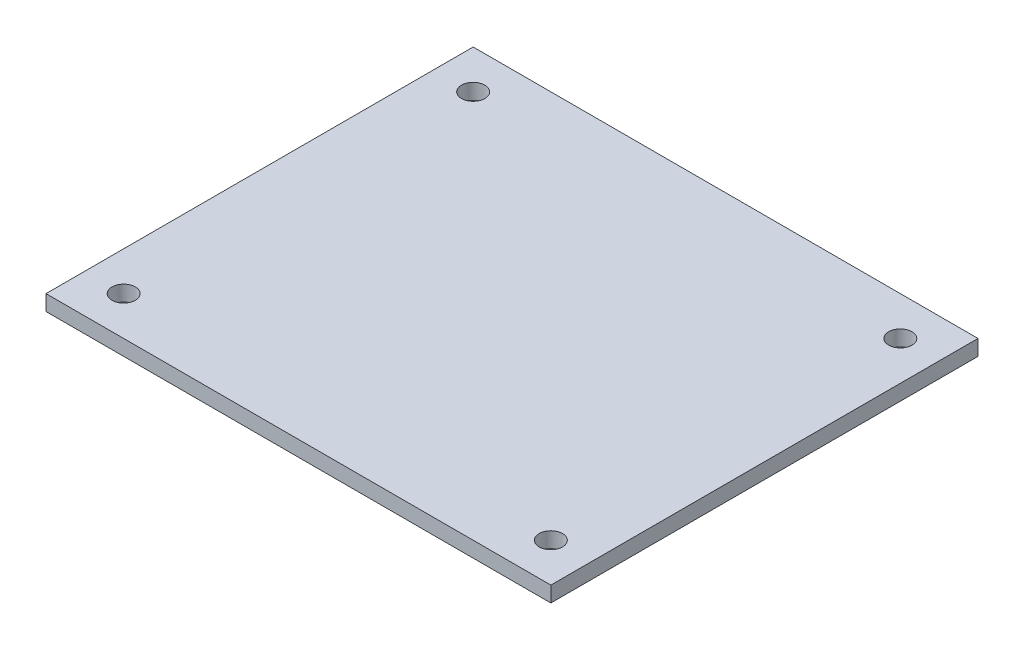
ISO-10303-21;
HEADER;
FILE_DESCRIPTION(('STEP AP214'),'2;1');
FILE_NAME('part.step','',(''),(''),'','','');
FILE_SCHEMA(('AUTOMOTIVE_DESIGN { 1 0 10303 214 1 1 1 1 }'));
ENDSEC;
DATA;
#1=APPLICATION_CONTEXT('core data for automotive mechanical design processes');
#2=APPLICATION_PROTOCOL_DEFINITION('international standard','automotive_design',2000,#1);
#3=PRODUCT_CONTEXT('',#1,'mechanical');
#4=PRODUCT('Part','Part','',(#3));
#5=PRODUCT_RELATED_PRODUCT_CATEGORY('part','',(#4));
#6=PRODUCT_DEFINITION_FORMATION('','',#4);
#7=PRODUCT_DEFINITION_CONTEXT('part definition',#1,'design');
#8=PRODUCT_DEFINITION('design','',#6,#7);
#9=PRODUCT_DEFINITION_SHAPE('','',#8);
#10=(LENGTH_UNIT() NAMED_UNIT(*) SI_UNIT(.MILLI.,.METRE.));
#11=(NAMED_UNIT(*) PLANE_ANGLE_UNIT() SI_UNIT($,.RADIAN.));
#12=(NAMED_UNIT(*) SI_UNIT($,.STERADIAN.) SOLID_ANGLE_UNIT());
#13=UNCERTAINTY_MEASURE_WITH_UNIT(LENGTH_MEASURE(1.E-05),#10,'distance_accuracy_value','');
#14=(GEOMETRIC_REPRESENTATION_CONTEXT(3) GLOBAL_UNCERTAINTY_ASSIGNED_CONTEXT((#13)) GLOBAL_UNIT_ASSIGNED_CONTEXT((#10,
#11,#12)) REPRESENTATION_CONTEXT('',''));
#15=CARTESIAN_POINT('',(0.,0.,0.));
#16=DIRECTION('',(0.,0.,1.));
#17=DIRECTION('',(1.,0.,0.));
#18=AXIS2_PLACEMENT_3D('',#15,#16,#17);
#19=CARTESIAN_POINT('',(32.5,2.,27.5));
#20=DIRECTION('',(-1.,0.,0.));
#21=DIRECTION('',(0.,0.,1.));
#22=AXIS2_PLACEMENT_3D('',#19,#20,#21);
#23=PLANE('',#22);
#24=DIRECTION('',(0.,0.,-1.));
#25=VECTOR('',#24,1.);
#26=CARTESIAN_POINT('',(32.5,0.,27.5));
#27=LINE('',#26,#25);
#28=CARTESIAN_POINT('',(32.5,0.,27.5));
#29=VERTEX_POINT('',#28);
#30=CARTESIAN_POINT('',(32.5,0.,-27.5));
#31=VERTEX_POINT('',#30);
#32=EDGE_CURVE('E96',#29,#31,#27,.T.);
#33=ORIENTED_EDGE('',*,*,#32,.T.);
#34=DIRECTION('',(0.,-1.,0.));
#35=VECTOR('',#34,1.);
#36=CARTESIAN_POINT('',(32.5,2.,-27.5));
#37=LINE('',#36,#35);
#38=CARTESIAN_POINT('',(32.5,2.,-27.5));
#39=VERTEX_POINT('',#38);
#40=EDGE_CURVE('E11',#39,#31,#37,.T.);
#41=ORIENTED_EDGE('',*,*,#40,.F.);
#42=DIRECTION('',(0.,0.,-1.));
#43=VECTOR('',#42,1.);
#44=CARTESIAN_POINT('',(32.5,2.,27.5));
#45=LINE('',#44,#43);
#46=CARTESIAN_POINT('',(32.5,2.,27.5));
#47=VERTEX_POINT('',#46);
#48=EDGE_CURVE('E84',#47,#39,#45,.T.);
#49=ORIENTED_EDGE('',*,*,#48,.F.);
#50=DIRECTION('',(0.,-1.,0.));
#51=VECTOR('',#50,1.);
#52=CARTESIAN_POINT('',(32.5,2.,27.5));
#53=LINE('',#52,#51);
#54=EDGE_CURVE('E92',#47,#29,#53,.T.);
#55=ORIENTED_EDGE('',*,*,#54,.T.);
#56=EDGE_LOOP('',(#33,#41,#49,#55));
#57=FACE_BOUND('',#56,.T.);
#58=ADVANCED_FACE('F33',(#57),#23,.F.);
#59=CARTESIAN_POINT('',(-32.5,2.,-27.5));
#60=DIRECTION('',(0.,0.,1.));
#61=DIRECTION('',(1.,0.,0.));
#62=AXIS2_PLACEMENT_3D('',#59,#60,#61);
#63=PLANE('',#62);
#64=DIRECTION('',(-1.,0.,0.));
#65=VECTOR('',#64,1.);
#66=CARTESIAN_POINT('',(-32.5,0.,-27.5));
#67=LINE('',#66,#65);
#68=CARTESIAN_POINT('',(-32.5,0.,-27.5));
#69=VERTEX_POINT('',#68);
#70=EDGE_CURVE('E88',#31,#69,#67,.T.);
#71=ORIENTED_EDGE('',*,*,#70,.T.);
#72=DIRECTION('',(0.,-1.,0.));
#73=VECTOR('',#72,1.);
#74=CARTESIAN_POINT('',(-32.5,2.,-27.5));
#75=LINE('',#74,#73);
#76=CARTESIAN_POINT('',(-32.5,2.,-27.5));
#77=VERTEX_POINT('',#76);
#78=EDGE_CURVE('E41',#77,#69,#75,.T.);
#79=ORIENTED_EDGE('',*,*,#78,.F.);
#80=DIRECTION('',(-1.,0.,0.));
#81=VECTOR('',#80,1.);
#82=CARTESIAN_POINT('',(-32.5,2.,-27.5));
#83=LINE('',#82,#81);
#84=EDGE_CURVE('E79',#39,#77,#83,.T.);
#85=ORIENTED_EDGE('',*,*,#84,.F.);
#86=ORIENTED_EDGE('',*,*,#40,.T.);
#87=EDGE_LOOP('',(#71,#79,#85,#86));
#88=FACE_BOUND('',#87,.T.);
#89=ADVANCED_FACE('F87',(#88),#63,.F.);
#90=CARTESIAN_POINT('',(-32.5,2.,27.5));
#91=DIRECTION('',(1.,0.,0.));
#92=DIRECTION('',(0.,0.,-1.));
#93=AXIS2_PLACEMENT_3D('',#90,#91,#92);
#94=PLANE('',#93);
#95=DIRECTION('',(0.,0.,1.));
#96=VECTOR('',#95,1.);
#97=CARTESIAN_POINT('',(-32.5,0.,27.5));
#98=LINE('',#97,#96);
#99=CARTESIAN_POINT('',(-32.5,0.,27.5));
#100=VERTEX_POINT('',#99);
#101=EDGE_CURVE('E66',#69,#100,#98,.T.);
#102=ORIENTED_EDGE('',*,*,#101,.T.);
#103=DIRECTION('',(0.,-1.,0.));
#104=VECTOR('',#103,1.);
#105=CARTESIAN_POINT('',(-32.5,2.,27.5));
#106=LINE('',#105,#104);
#107=CARTESIAN_POINT('',(-32.5,2.,27.5));
#108=VERTEX_POINT('',#107);
#109=EDGE_CURVE('E89',#108,#100,#106,.T.);
#110=ORIENTED_EDGE('',*,*,#109,.F.);
#111=DIRECTION('',(0.,0.,1.));
#112=VECTOR('',#111,1.);
#113=CARTESIAN_POINT('',(-32.5,2.,27.5));
#114=LINE('',#113,#112);
#115=EDGE_CURVE('E82',#77,#108,#114,.T.);
#116=ORIENTED_EDGE('',*,*,#115,.F.);
#117=ORIENTED_EDGE('',*,*,#78,.T.);
#118=EDGE_LOOP('',(#102,#110,#116,#117));
#119=FACE_BOUND('',#118,.T.);
#120=ADVANCED_FACE('F90',(#119),#94,.F.);
#121=CARTESIAN_POINT('',(-32.5,2.,27.5));
#122=DIRECTION('',(0.,0.,-1.));
#123=DIRECTION('',(-1.,0.,0.));
#124=AXIS2_PLACEMENT_3D('',#121,#122,#123);
#125=PLANE('',#124);
#126=DIRECTION('',(1.,0.,0.));
#127=VECTOR('',#126,1.);
#128=CARTESIAN_POINT('',(-32.5,0.,27.5));
#129=LINE('',#128,#127);
#130=EDGE_CURVE('E72',#100,#29,#129,.T.);
#131=ORIENTED_EDGE('',*,*,#130,.T.);
#132=ORIENTED_EDGE('',*,*,#54,.F.);
#133=DIRECTION('',(1.,0.,0.));
#134=VECTOR('',#133,1.);
#135=CARTESIAN_POINT('',(-32.5,2.,27.5));
#136=LINE('',#135,#134);
#137=EDGE_CURVE('E49',#108,#47,#136,.T.);
#138=ORIENTED_EDGE('',*,*,#137,.F.);
#139=ORIENTED_EDGE('',*,*,#109,.T.);
#140=EDGE_LOOP('',(#131,#132,#138,#139));
#141=FACE_BOUND('',#140,.T.);
#142=ADVANCED_FACE('F104',(#141),#125,.F.);
#143=CARTESIAN_POINT('',(0.,2.,0.));
#144=DIRECTION('',(0.,-1.,0.));
#145=DIRECTION('',(0.,0.,-1.));
#146=AXIS2_PLACEMENT_3D('',#143,#144,#145);
#147=PLANE('',#146);
#148=CARTESIAN_POINT('',(-27.5,2.,22.5));
#149=DIRECTION('',(0.,1.,0.));
#150=DIRECTION('',(0.,0.,1.));
#151=AXIS2_PLACEMENT_3D('',#148,#149,#150);
#152=CIRCLE('',#151,1.5);
#153=CARTESIAN_POINT('',(-27.5,2.,24.));
#154=VERTEX_POINT('',#153);
#155=EDGE_CURVE('E116',#154,#154,#152,.T.);
#156=ORIENTED_EDGE('',*,*,#155,.F.);
#157=EDGE_LOOP('',(#156));
#158=FACE_BOUND('',#157,.T.);
#159=CARTESIAN_POINT('',(27.5,2.,22.5));
#160=DIRECTION('',(0.,1.,0.));
#161=DIRECTION('',(0.,0.,1.));
#162=AXIS2_PLACEMENT_3D('',#159,#160,#161);
#163=CIRCLE('',#162,1.5);
#164=CARTESIAN_POINT('',(27.5,2.,24.));
#165=VERTEX_POINT('',#164);
#166=EDGE_CURVE('E122',#165,#165,#163,.T.);
#167=ORIENTED_EDGE('',*,*,#166,.F.);
#168=EDGE_LOOP('',(#167));
#169=FACE_BOUND('',#168,.T.);
#170=CARTESIAN_POINT('',(27.5,2.,-22.5));
#171=DIRECTION('',(0.,1.,0.));
#172=DIRECTION('',(0.,0.,1.));
#173=AXIS2_PLACEMENT_3D('',#170,#171,#172);
#174=CIRCLE('',#173,1.5);
#175=CARTESIAN_POINT('',(27.5,2.,-21.));
#176=VERTEX_POINT('',#175);
#177=EDGE_CURVE('E128',#176,#176,#174,.T.);
#178=ORIENTED_EDGE('',*,*,#177,.F.);
#179=EDGE_LOOP('',(#178));
#180=FACE_BOUND('',#179,.T.);
#181=CARTESIAN_POINT('',(-27.5,2.,-22.5));
#182=DIRECTION('',(0.,1.,0.));
#183=DIRECTION('',(0.,0.,1.));
#184=AXIS2_PLACEMENT_3D('',#181,#182,#183);
#185=CIRCLE('',#184,1.5);
#186=CARTESIAN_POINT('',(-27.5,2.,-21.));
#187=VERTEX_POINT('',#186);
#188=EDGE_CURVE('E110',#187,#187,#185,.T.);
#189=ORIENTED_EDGE('',*,*,#188,.F.);
#190=EDGE_LOOP('',(#189));
#191=FACE_BOUND('',#190,.T.);
#192=ORIENTED_EDGE('',*,*,#48,.T.);
#193=ORIENTED_EDGE('',*,*,#84,.T.);
#194=ORIENTED_EDGE('',*,*,#115,.T.);
#195=ORIENTED_EDGE('',*,*,#137,.T.);
#196=EDGE_LOOP('',(#192,#193,#194,#195));
#197=FACE_BOUND('',#196,.T.);
#198=ADVANCED_FACE('F80',(#158,#169,#180,#191,#197),#147,.F.);
#199=CARTESIAN_POINT('',(0.,0.,0.));
#200=DIRECTION('',(0.,-1.,0.));
#201=DIRECTION('',(0.,0.,-1.));
#202=AXIS2_PLACEMENT_3D('',#199,#200,#201);
#203=PLANE('',#202);
#204=CARTESIAN_POINT('',(-27.5,0.,22.5));
#205=DIRECTION('',(0.,1.,0.));
#206=DIRECTION('',(0.,0.,1.));
#207=AXIS2_PLACEMENT_3D('',#204,#205,#206);
#208=CIRCLE('',#207,1.5);
#209=CARTESIAN_POINT('',(-27.5,0.,24.));
#210=VERTEX_POINT('',#209);
#211=EDGE_CURVE('E119',#210,#210,#208,.T.);
#212=ORIENTED_EDGE('',*,*,#211,.T.);
#213=EDGE_LOOP('',(#212));
#214=FACE_BOUND('',#213,.T.);
#215=CARTESIAN_POINT('',(27.5,0.,22.5));
#216=DIRECTION('',(0.,1.,0.));
#217=DIRECTION('',(0.,0.,1.));
#218=AXIS2_PLACEMENT_3D('',#215,#216,#217);
#219=CIRCLE('',#218,1.5);
#220=CARTESIAN_POINT('',(27.5,0.,24.));
#221=VERTEX_POINT('',#220);
#222=EDGE_CURVE('E125',#221,#221,#219,.T.);
#223=ORIENTED_EDGE('',*,*,#222,.T.);
#224=EDGE_LOOP('',(#223));
#225=FACE_BOUND('',#224,.T.);
#226=CARTESIAN_POINT('',(27.5,0.,-22.5));
#227=DIRECTION('',(0.,1.,0.));
#228=DIRECTION('',(0.,0.,1.));
#229=AXIS2_PLACEMENT_3D('',#226,#227,#228);
#230=CIRCLE('',#229,1.5);
#231=CARTESIAN_POINT('',(27.5,0.,-21.));
#232=VERTEX_POINT('',#231);
#233=EDGE_CURVE('E113',#232,#232,#230,.T.);
#234=ORIENTED_EDGE('',*,*,#233,.T.);
#235=EDGE_LOOP('',(#234));
#236=FACE_BOUND('',#235,.T.);
#237=CARTESIAN_POINT('',(-27.5,0.,-22.5));
#238=DIRECTION('',(0.,1.,0.));
#239=DIRECTION('',(0.,0.,1.));
#240=AXIS2_PLACEMENT_3D('',#237,#238,#239);
#241=CIRCLE('',#240,1.5);
#242=CARTESIAN_POINT('',(-27.5,0.,-21.));
#243=VERTEX_POINT('',#242);
#244=EDGE_CURVE('E99',#243,#243,#241,.T.);
#245=ORIENTED_EDGE('',*,*,#244,.T.);
#246=EDGE_LOOP('',(#245));
#247=FACE_BOUND('',#246,.T.);
#248=ORIENTED_EDGE('',*,*,#32,.F.);
#249=ORIENTED_EDGE('',*,*,#130,.F.);
#250=ORIENTED_EDGE('',*,*,#101,.F.);
#251=ORIENTED_EDGE('',*,*,#70,.F.);
#252=EDGE_LOOP('',(#248,#249,#250,#251));
#253=FACE_BOUND('',#252,.T.);
#254=ADVANCED_FACE('F107',(#214,#225,#236,#247,#253),#203,.T.);
#255=CARTESIAN_POINT('',(-27.5,0.,-22.5));
#256=DIRECTION('',(0.,1.,0.));
#257=DIRECTION('',(0.,0.,1.));
#258=AXIS2_PLACEMENT_3D('',#255,#256,#257);
#259=CYLINDRICAL_SURFACE('',#258,1.5);
#260=ORIENTED_EDGE('',*,*,#244,.F.);
#261=EDGE_LOOP('',(#260));
#262=FACE_BOUND('',#261,.T.);
#263=ORIENTED_EDGE('',*,*,#188,.T.);
#264=EDGE_LOOP('',(#263));
#265=FACE_BOUND('',#264,.T.);
#266=ADVANCED_FACE('F140',(#262,#265),#259,.F.);
#267=CARTESIAN_POINT('',(27.5,0.,-22.5));
#268=DIRECTION('',(0.,1.,0.));
#269=DIRECTION('',(0.,0.,1.));
#270=AXIS2_PLACEMENT_3D('',#267,#268,#269);
#271=CYLINDRICAL_SURFACE('',#270,1.5);
#272=ORIENTED_EDGE('',*,*,#233,.F.);
#273=EDGE_LOOP('',(#272));
#274=FACE_BOUND('',#273,.T.);
#275=ORIENTED_EDGE('',*,*,#177,.T.);
#276=EDGE_LOOP('',(#275));
#277=FACE_BOUND('',#276,.T.);
#278=ADVANCED_FACE('F136',(#274,#277),#271,.F.);
#279=CARTESIAN_POINT('',(27.5,0.,22.5));
#280=DIRECTION('',(0.,1.,0.));
#281=DIRECTION('',(0.,0.,1.));
#282=AXIS2_PLACEMENT_3D('',#279,#280,#281);
#283=CYLINDRICAL_SURFACE('',#282,1.5);
#284=ORIENTED_EDGE('',*,*,#222,.F.);
#285=EDGE_LOOP('',(#284));
#286=FACE_BOUND('',#285,.T.);
#287=ORIENTED_EDGE('',*,*,#166,.T.);
#288=EDGE_LOOP('',(#287));
#289=FACE_BOUND('',#288,.T.);
#290=ADVANCED_FACE('F139',(#286,#289),#283,.F.);
#291=CARTESIAN_POINT('',(-27.5,0.,22.5));
#292=DIRECTION('',(0.,1.,0.));
#293=DIRECTION('',(0.,0.,1.));
#294=AXIS2_PLACEMENT_3D('',#291,#292,#293);
#295=CYLINDRICAL_SURFACE('',#294,1.5);
#296=ORIENTED_EDGE('',*,*,#211,.F.);
#297=EDGE_LOOP('',(#296));
#298=FACE_BOUND('',#297,.T.);
#299=ORIENTED_EDGE('',*,*,#155,.T.);
#300=EDGE_LOOP('',(#299));
#301=FACE_BOUND('',#300,.T.);
#302=ADVANCED_FACE('F201',(#298,#301),#295,.F.);
#303=CLOSED_SHELL('',(#58,#89,#120,#142,#198,#254,#266,#278,#290,#302));
#304=MANIFOLD_SOLID_BREP('B2',#303);
#305=ADVANCED_BREP_SHAPE_REPRESENTATION('',(#18,#304),#14);
#306=SHAPE_DEFINITION_REPRESENTATION(#9,#305);
ENDSEC;
END-ISO-10303-21;
